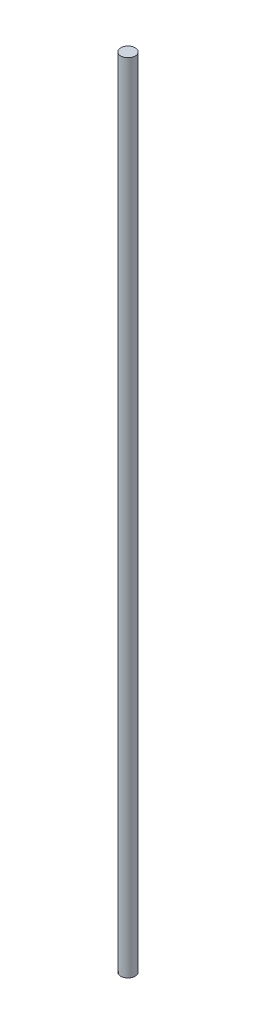
ISO-10303-21;
HEADER;
FILE_DESCRIPTION(('STEP AP214'),'2;1');
FILE_NAME('part.step','',(''),(''),'','','');
FILE_SCHEMA(('AUTOMOTIVE_DESIGN { 1 0 10303 214 1 1 1 1 }'));
ENDSEC;
DATA;
#1=APPLICATION_CONTEXT('core data for automotive mechanical design processes');
#2=APPLICATION_PROTOCOL_DEFINITION('international standard','automotive_design',2000,#1);
#3=PRODUCT_CONTEXT('',#1,'mechanical');
#4=PRODUCT('Part','Part','',(#3));
#5=PRODUCT_RELATED_PRODUCT_CATEGORY('part','',(#4));
#6=PRODUCT_DEFINITION_FORMATION('','',#4);
#7=PRODUCT_DEFINITION_CONTEXT('part definition',#1,'design');
#8=PRODUCT_DEFINITION('design','',#6,#7);
#9=PRODUCT_DEFINITION_SHAPE('','',#8);
#10=(LENGTH_UNIT() NAMED_UNIT(*) SI_UNIT(.MILLI.,.METRE.));
#11=(NAMED_UNIT(*) PLANE_ANGLE_UNIT() SI_UNIT($,.RADIAN.));
#12=(NAMED_UNIT(*) SI_UNIT($,.STERADIAN.) SOLID_ANGLE_UNIT());
#13=UNCERTAINTY_MEASURE_WITH_UNIT(LENGTH_MEASURE(1.E-05),#10,'distance_accuracy_value','');
#14=(GEOMETRIC_REPRESENTATION_CONTEXT(3) GLOBAL_UNCERTAINTY_ASSIGNED_CONTEXT((#13)) GLOBAL_UNIT_ASSIGNED_CONTEXT((#10,
#11,#12)) REPRESENTATION_CONTEXT('',''));
#15=CARTESIAN_POINT('',(0.,0.,0.));
#16=DIRECTION('',(0.,0.,1.));
#17=DIRECTION('',(1.,0.,0.));
#18=AXIS2_PLACEMENT_3D('',#15,#16,#17);
#19=CARTESIAN_POINT('',(0.,221.5,0.));
#20=DIRECTION('',(0.,-1.,0.));
#21=DIRECTION('',(0.,0.,-1.));
#22=AXIS2_PLACEMENT_3D('',#19,#20,#21);
#23=CYLINDRICAL_SURFACE('',#22,4.);
#24=CARTESIAN_POINT('',(0.,221.5,0.));
#25=DIRECTION('',(0.,1.,0.));
#26=DIRECTION('',(0.,0.,1.));
#27=AXIS2_PLACEMENT_3D('',#24,#25,#26);
#28=CIRCLE('',#27,4.);
#29=CARTESIAN_POINT('',(0.,221.5,4.));
#30=VERTEX_POINT('',#29);
#31=EDGE_CURVE('E10',#30,#30,#28,.T.);
#32=ORIENTED_EDGE('',*,*,#31,.F.);
#33=EDGE_LOOP('',(#32));
#34=FACE_BOUND('',#33,.T.);
#35=CARTESIAN_POINT('',(0.,-221.5,0.));
#36=DIRECTION('',(0.,1.,0.));
#37=DIRECTION('',(0.,0.,1.));
#38=AXIS2_PLACEMENT_3D('',#35,#36,#37);
#39=CIRCLE('',#38,4.);
#40=CARTESIAN_POINT('',(0.,-221.5,4.));
#41=VERTEX_POINT('',#40);
#42=EDGE_CURVE('E40',#41,#41,#39,.T.);
#43=ORIENTED_EDGE('',*,*,#42,.T.);
#44=EDGE_LOOP('',(#43));
#45=FACE_BOUND('',#44,.T.);
#46=ADVANCED_FACE('F37',(#34,#45),#23,.T.);
#47=CARTESIAN_POINT('',(0.,221.5,0.));
#48=DIRECTION('',(0.,1.,0.));
#49=DIRECTION('',(0.,0.,1.));
#50=AXIS2_PLACEMENT_3D('',#47,#48,#49);
#51=PLANE('',#50);
#52=ORIENTED_EDGE('',*,*,#31,.T.);
#53=EDGE_LOOP('',(#52));
#54=FACE_BOUND('',#53,.T.);
#55=ADVANCED_FACE('F54',(#54),#51,.T.);
#56=CARTESIAN_POINT('',(0.,-221.5,0.));
#57=DIRECTION('',(0.,1.,0.));
#58=DIRECTION('',(0.,0.,1.));
#59=AXIS2_PLACEMENT_3D('',#56,#57,#58);
#60=PLANE('',#59);
#61=ORIENTED_EDGE('',*,*,#42,.F.);
#62=EDGE_LOOP('',(#61));
#63=FACE_BOUND('',#62,.T.);
#64=ADVANCED_FACE('F52',(#63),#60,.F.);
#65=CLOSED_SHELL('',(#46,#55,#64));
#66=MANIFOLD_SOLID_BREP('B2',#65);
#67=ADVANCED_BREP_SHAPE_REPRESENTATION('',(#18,#66),#14);
#68=SHAPE_DEFINITION_REPRESENTATION(#9,#67);
ENDSEC;
END-ISO-10303-21;
